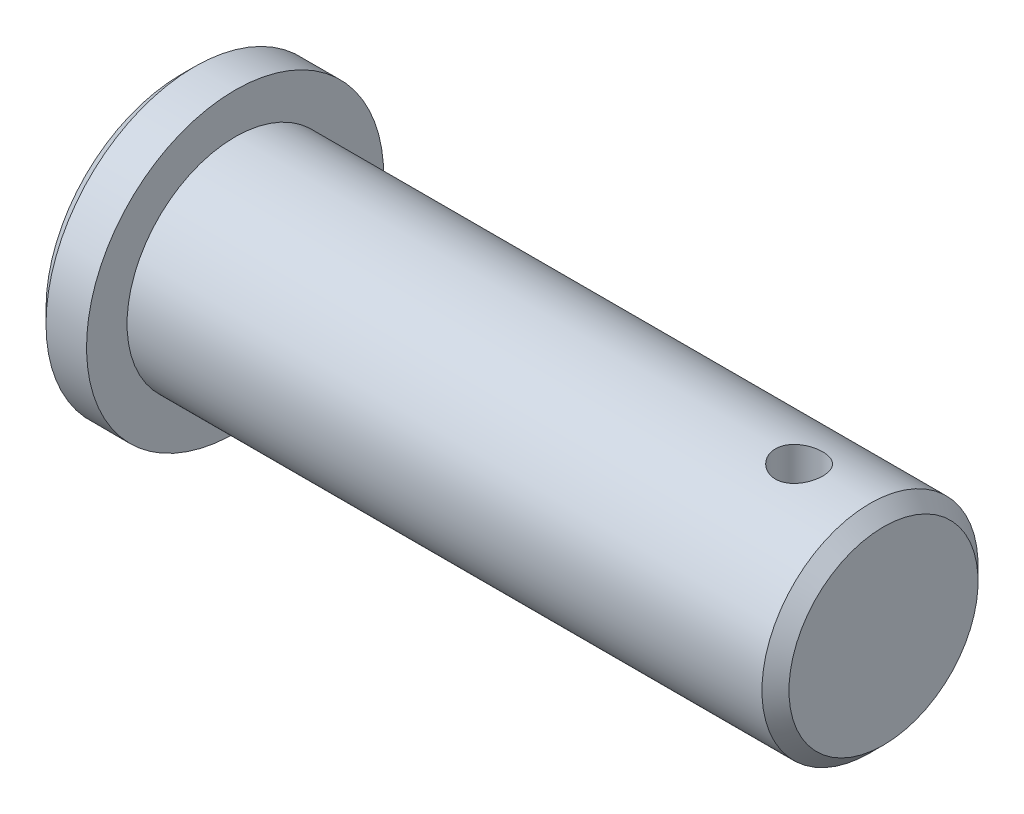
ISO-10303-21;
HEADER;
FILE_DESCRIPTION(('STEP AP214'),'2;1');
FILE_NAME('part.step','',(''),(''),'','','');
FILE_SCHEMA(('AUTOMOTIVE_DESIGN { 1 0 10303 214 1 1 1 1 }'));
ENDSEC;
DATA;
#1=APPLICATION_CONTEXT('core data for automotive mechanical design processes');
#2=APPLICATION_PROTOCOL_DEFINITION('international standard','automotive_design',2000,#1);
#3=PRODUCT_CONTEXT('',#1,'mechanical');
#4=PRODUCT('Part','Part','',(#3));
#5=PRODUCT_RELATED_PRODUCT_CATEGORY('part','',(#4));
#6=PRODUCT_DEFINITION_FORMATION('','',#4);
#7=PRODUCT_DEFINITION_CONTEXT('part definition',#1,'design');
#8=PRODUCT_DEFINITION('design','',#6,#7);
#9=PRODUCT_DEFINITION_SHAPE('','',#8);
#10=(LENGTH_UNIT() NAMED_UNIT(*) SI_UNIT(.MILLI.,.METRE.));
#11=(NAMED_UNIT(*) PLANE_ANGLE_UNIT() SI_UNIT($,.RADIAN.));
#12=(NAMED_UNIT(*) SI_UNIT($,.STERADIAN.) SOLID_ANGLE_UNIT());
#13=UNCERTAINTY_MEASURE_WITH_UNIT(LENGTH_MEASURE(1.E-05),#10,'distance_accuracy_value','');
#14=(GEOMETRIC_REPRESENTATION_CONTEXT(3) GLOBAL_UNCERTAINTY_ASSIGNED_CONTEXT((#13)) GLOBAL_UNIT_ASSIGNED_CONTEXT((#10,
#11,#12)) REPRESENTATION_CONTEXT('',''));
#15=CARTESIAN_POINT('',(0.,0.,0.));
#16=DIRECTION('',(0.,0.,1.));
#17=DIRECTION('',(1.,0.,0.));
#18=AXIS2_PLACEMENT_3D('',#15,#16,#17);
#19=CARTESIAN_POINT('',(0.,0.,0.));
#20=DIRECTION('',(-1.,0.,0.));
#21=DIRECTION('',(0.,-1.,0.));
#22=AXIS2_PLACEMENT_3D('',#19,#20,#21);
#23=PLANE('',#22);
#24=CARTESIAN_POINT('',(0.,0.,0.));
#25=DIRECTION('',(-1.,0.,0.));
#26=DIRECTION('',(0.,-1.,0.));
#27=AXIS2_PLACEMENT_3D('',#24,#25,#26);
#28=CIRCLE('',#27,9.99999999999997);
#29=CARTESIAN_POINT('',(0.,-9.99999999999997,0.));
#30=VERTEX_POINT('',#29);
#31=EDGE_CURVE('E12',#30,#30,#28,.T.);
#32=ORIENTED_EDGE('',*,*,#31,.T.);
#33=EDGE_LOOP('',(#32));
#34=FACE_BOUND('',#33,.T.);
#35=ADVANCED_FACE('F48',(#34),#23,.T.);
#36=CARTESIAN_POINT('',(52.,-1.66533453693773E-13,0.));
#37=DIRECTION('',(1.,0.,0.));
#38=DIRECTION('',(0.,1.,0.));
#39=AXIS2_PLACEMENT_3D('',#36,#37,#38);
#40=CYLINDRICAL_SURFACE('',#39,11.);
#41=CARTESIAN_POINT('',(1.00000000000003,0.,0.));
#42=DIRECTION('',(-1.,0.,0.));
#43=DIRECTION('',(0.,-1.,0.));
#44=AXIS2_PLACEMENT_3D('',#41,#42,#43);
#45=CIRCLE('',#44,11.);
#46=CARTESIAN_POINT('',(1.00000000000003,-11.,0.));
#47=VERTEX_POINT('',#46);
#48=EDGE_CURVE('E56',#47,#47,#45,.F.);
#49=ORIENTED_EDGE('',*,*,#48,.T.);
#50=EDGE_LOOP('',(#49));
#51=FACE_BOUND('',#50,.T.);
#52=CARTESIAN_POINT('',(4.,0.,0.));
#53=DIRECTION('',(1.,0.,0.));
#54=DIRECTION('',(0.,1.,0.));
#55=AXIS2_PLACEMENT_3D('',#52,#53,#54);
#56=CIRCLE('',#55,11.);
#57=CARTESIAN_POINT('',(4.,11.,0.));
#58=VERTEX_POINT('',#57);
#59=EDGE_CURVE('E69',#58,#58,#56,.T.);
#60=ORIENTED_EDGE('',*,*,#59,.F.);
#61=EDGE_LOOP('',(#60));
#62=FACE_BOUND('',#61,.T.);
#63=ADVANCED_FACE('F103',(#51,#62),#40,.T.);
#64=CARTESIAN_POINT('',(4.00000000000009,11.,0.));
#65=DIRECTION('',(1.,0.,0.));
#66=DIRECTION('',(0.,1.,0.));
#67=AXIS2_PLACEMENT_3D('',#64,#65,#66);
#68=PLANE('',#67);
#69=ORIENTED_EDGE('',*,*,#59,.T.);
#70=EDGE_LOOP('',(#69));
#71=FACE_BOUND('',#70,.T.);
#72=CARTESIAN_POINT('',(4.,0.,0.));
#73=DIRECTION('',(1.,0.,0.));
#74=DIRECTION('',(0.,1.,0.));
#75=AXIS2_PLACEMENT_3D('',#72,#73,#74);
#76=CIRCLE('',#75,8.);
#77=CARTESIAN_POINT('',(4.,8.,0.));
#78=VERTEX_POINT('',#77);
#79=EDGE_CURVE('E78',#78,#78,#76,.T.);
#80=ORIENTED_EDGE('',*,*,#79,.F.);
#81=EDGE_LOOP('',(#80));
#82=FACE_BOUND('',#81,.T.);
#83=ADVANCED_FACE('F100',(#71,#82),#68,.T.);
#84=CARTESIAN_POINT('',(52.,-1.66533453693773E-13,0.));
#85=DIRECTION('',(1.,0.,0.));
#86=DIRECTION('',(0.,1.,0.));
#87=AXIS2_PLACEMENT_3D('',#84,#85,#86);
#88=CYLINDRICAL_SURFACE('',#87,8.);
#89=CARTESIAN_POINT('',(51.,-1.66533453693773E-13,0.));
#90=DIRECTION('',(1.,0.,0.));
#91=DIRECTION('',(0.,1.,0.));
#92=AXIS2_PLACEMENT_3D('',#89,#90,#91);
#93=CIRCLE('',#92,8.);
#94=CARTESIAN_POINT('',(51.,7.99999999999983,0.));
#95=VERTEX_POINT('',#94);
#96=EDGE_CURVE('E60',#95,#95,#93,.F.);
#97=ORIENTED_EDGE('',*,*,#96,.T.);
#98=EDGE_LOOP('',(#97));
#99=FACE_BOUND('',#98,.T.);
#100=CARTESIAN_POINT('',(44.,7.99999999999984,0.));
#101=CARTESIAN_POINT('',(44.0000033142635,7.99999820976183,0.0970593350151634));
#102=CARTESIAN_POINT('',(44.0081019866613,7.9982157049818,0.194158718935764));
#103=CARTESIAN_POINT('',(44.0402490527665,7.99127711250693,0.38559939342519));
#104=CARTESIAN_POINT('',(44.0643088421448,7.9861186145083,0.479938663088241));
#105=CARTESIAN_POINT('',(44.127588488285,7.97300239075887,0.663064722809449));
#106=CARTESIAN_POINT('',(44.16679250776,7.96504759005967,0.751857201182264));
#107=CARTESIAN_POINT('',(44.2591974966815,7.94719730036176,0.921601058551578));
#108=CARTESIAN_POINT('',(44.3123981043793,7.93730186152146,1.00255264012588));
#109=CARTESIAN_POINT('',(44.4321897106249,7.91647673705155,1.15561917902204));
#110=CARTESIAN_POINT('',(44.498962313401,7.90553422192277,1.22759027771493));
#111=CARTESIAN_POINT('',(44.6436126129037,7.88393863133668,1.3594054745263));
#112=CARTESIAN_POINT('',(44.7214912989117,7.87328558176445,1.41924849117725));
#113=CARTESIAN_POINT('',(44.8872067655839,7.85334859305521,1.52574354875191));
#114=CARTESIAN_POINT('',(44.9751441231795,7.84408109293118,1.57224243577139));
#115=CARTESIAN_POINT('',(45.1578208420114,7.82814863989322,1.64974688983709));
#116=CARTESIAN_POINT('',(45.2525593882079,7.82148337574729,1.68075430981411));
#117=CARTESIAN_POINT('',(45.4445886950388,7.81164071268246,1.72592019766615));
#118=CARTESIAN_POINT('',(45.5418167912855,7.80841064771994,1.74033336961636));
#119=CARTESIAN_POINT('',(45.7373605607896,7.80564592573952,1.75269359259674));
#120=CARTESIAN_POINT('',(45.8356760988531,7.80611081439794,1.75064266801701));
#121=CARTESIAN_POINT('',(46.0287103351035,7.8106357936338,1.73033788658276));
#122=CARTESIAN_POINT('',(46.1234619300579,7.81463022611741,1.71237992433051));
#123=CARTESIAN_POINT('',(46.3085741129167,7.82566041064124,1.66123961776058));
#124=CARTESIAN_POINT('',(46.398934454106,7.8326963333431,1.62805641913033));
#125=CARTESIAN_POINT('',(46.5735309342898,7.84908142575229,1.5471359025917));
#126=CARTESIAN_POINT('',(46.6577125864212,7.858448566835,1.49928481262594));
#127=CARTESIAN_POINT('',(46.8169609182198,7.87842963219266,1.39046682908872));
#128=CARTESIAN_POINT('',(46.8920263529621,7.88904372636496,1.32949814730234));
#129=CARTESIAN_POINT('',(47.0326149603923,7.91060446260807,1.19460937489082));
#130=CARTESIAN_POINT('',(47.0978966247337,7.92155333191829,1.12043767851035));
#131=CARTESIAN_POINT('',(47.2151337625978,7.94234089245343,0.962075236204365));
#132=CARTESIAN_POINT('',(47.267088994629,7.95217956355836,0.877884308758433));
#133=CARTESIAN_POINT('',(47.3562581576324,7.96967012140703,0.701578448800833));
#134=CARTESIAN_POINT('',(47.3934404360735,7.97731730300512,0.6094470111021));
#135=CARTESIAN_POINT('',(47.4517288669676,7.98952827368563,0.420039431240132));
#136=CARTESIAN_POINT('',(47.4728373576619,7.99409251123058,0.322764039566416));
#137=CARTESIAN_POINT('',(47.4980277338165,7.99955949359521,0.127901429629168));
#138=CARTESIAN_POINT('',(47.5024395226814,8.0005331727692,0.0303587923624011));
#139=CARTESIAN_POINT('',(47.4950054564991,7.99890811067594,-0.164069740933717));
#140=CARTESIAN_POINT('',(47.4831607043853,7.99630961176494,-0.260955681068868));
#141=CARTESIAN_POINT('',(47.4438233351162,7.98787693126438,-0.450227474165155));
#142=CARTESIAN_POINT('',(47.4165037581911,7.98207854907278,-0.542651027433261));
#143=CARTESIAN_POINT('',(47.3471843139132,7.96789511342695,-0.721603760326955));
#144=CARTESIAN_POINT('',(47.3051831956978,7.95950983957756,-0.808132436960159));
#145=CARTESIAN_POINT('',(47.2070055863417,7.94090779663341,-0.974203283713581));
#146=CARTESIAN_POINT('',(47.1506352964623,7.93066659115609,-1.05362808603427));
#147=CARTESIAN_POINT('',(47.0255746886628,7.90953858077042,-1.20200932191071));
#148=CARTESIAN_POINT('',(46.9568827703147,7.89865169211886,-1.2709643934262));
#149=CARTESIAN_POINT('',(46.8076149766915,7.87721432670236,-1.39775310506235));
#150=CARTESIAN_POINT('',(46.7268433768909,7.8666737506977,-1.45535830381535));
#151=CARTESIAN_POINT('',(46.556578421308,7.84735161891479,-1.55618726114744));
#152=CARTESIAN_POINT('',(46.46708544312,7.83856998703283,-1.59941164199059));
#153=CARTESIAN_POINT('',(46.2823979646719,7.8238438879188,-1.66996009440667));
#154=CARTESIAN_POINT('',(46.1872389451376,7.81788350386428,-1.69737356394448));
#155=CARTESIAN_POINT('',(45.9935179953597,7.80944608384981,-1.73578387332272));
#156=CARTESIAN_POINT('',(45.8949566119869,7.80696849073831,-1.74678333897331));
#157=CARTESIAN_POINT('',(45.6995320753198,7.80581228747115,-1.75194163710046));
#158=CARTESIAN_POINT('',(45.6026787903827,7.80705196674931,-1.74646267912393));
#159=CARTESIAN_POINT('',(45.4113113769032,7.81300583032503,-1.71962942041961));
#160=CARTESIAN_POINT('',(45.3167972207982,7.81771997366199,-1.69827530684468));
#161=CARTESIAN_POINT('',(45.1330787683617,7.83005176572564,-1.64047291068329));
#162=CARTESIAN_POINT('',(45.0438571574274,7.83765926522119,-1.60407735181833));
#163=CARTESIAN_POINT('',(44.872732708445,7.85492457749738,-1.51727048968564));
#164=CARTESIAN_POINT('',(44.7908306342505,7.86458260391305,-1.46685772585982));
#165=CARTESIAN_POINT('',(44.6348846515863,7.8851048314272,-1.35224615086081));
#166=CARTESIAN_POINT('',(44.5610331054936,7.89598947159443,-1.28778921304301));
#167=CARTESIAN_POINT('',(44.4250757530738,7.91760116007119,-1.14744205512987));
#168=CARTESIAN_POINT('',(44.3629726659186,7.92832817136905,-1.07154919548322));
#169=CARTESIAN_POINT('',(44.2515036651478,7.94858104101283,-0.909297791240168));
#170=CARTESIAN_POINT('',(44.2023134872506,7.95808950687116,-0.822816221637437));
#171=CARTESIAN_POINT('',(44.1192452996235,7.97465942662421,-0.64262278337423));
#172=CARTESIAN_POINT('',(44.0853544503659,7.98172293121773,-0.548917055005231));
#173=CARTESIAN_POINT('',(44.039885963761,7.99134698819844,-0.379265181966476));
#174=CARTESIAN_POINT('',(44.0249572710945,7.99457176616451,-0.30423670792359));
#175=CARTESIAN_POINT('',(44.0050132041954,7.99889892979319,-0.152813724405269));
#176=CARTESIAN_POINT('',(43.9999973905281,8.00000140953651,-0.0764192756345294));
#177=CARTESIAN_POINT('',(44.,7.99999999999984,0.));
#178=B_SPLINE_CURVE_WITH_KNOTS('',3,(#100,#101,#102,#103,#104,#105,#106,#107,#108,#109,#110,
#111,#112,#113,#114,#115,#116,#117,#118,#119,#120,#121,#122,#123,#124,#125,#126,#127,#128,#129,
#130,#131,#132,#133,#134,#135,#136,#137,#138,#139,#140,#141,#142,#143,#144,#145,#146,#147,#148,
#149,#150,#151,#152,#153,#154,#155,#156,#157,#158,#159,#160,#161,#162,#163,#164,#165,#166,#167,
#168,#169,#170,#171,#172,#173,#174,#175,#176,#177),.UNSPECIFIED.,.T.,.F.,(4,2,2,2,2,2,2,2,2,2,2,
2,2,2,2,2,2,2,2,2,2,2,2,2,2,2,2,2,2,2,2,2,2,2,2,2,2,2,4),(0.,0.290898279236839,
0.582004473362001,0.872807059744413,1.16360213093151,1.45858009706577,1.7535843549802,
2.05185017097239,2.3500803029129,2.64366919108495,2.93722198074803,3.22542630469489,
3.51364680222945,3.80416202417277,4.09471687482171,4.39155618463579,4.68840087316609,
4.9858781948911,5.2833122345532,5.57483775277441,5.86634349327399,6.15465219015977,
6.44298545684156,6.73543477188155,7.02792210003658,7.3258010778639,7.62366716466541,
7.91983211728112,8.21594968619038,8.50560626091061,8.79525942091186,9.08390577736448,
9.37258222133173,9.66709530846839,9.96167647726523,10.2600801610668,10.5582329503546,
10.7872806901089,11.0163182760262),.UNSPECIFIED.);
#179=CARTESIAN_POINT('',(44.,7.99999999999984,0.));
#180=VERTEX_POINT('',#179);
#181=EDGE_CURVE('E70',#180,#180,#178,.T.);
#182=ORIENTED_EDGE('',*,*,#181,.F.);
#183=EDGE_LOOP('',(#182));
#184=FACE_BOUND('',#183,.T.);
#185=CARTESIAN_POINT('',(45.75,-7.80624749799813,1.75000000000001));
#186=CARTESIAN_POINT('',(45.6529719865672,-7.80624945905149,1.74999666332348));
#187=CARTESIAN_POINT('',(45.5559038686893,-7.8080762204647,1.74190303951004));
#188=CARTESIAN_POINT('',(45.3645280954781,-7.81517245186522,1.70977784205174));
#189=CARTESIAN_POINT('',(45.2702224871333,-7.82044441049029,1.68573474711855));
#190=CARTESIAN_POINT('',(45.0871677516,-7.83380603690756,1.62250390010282));
#191=CARTESIAN_POINT('',(44.9984126505749,-7.84189261163083,1.58333276753286));
#192=CARTESIAN_POINT('',(44.8287319161546,-7.85996859341382,1.49100532370988));
#193=CARTESIAN_POINT('',(44.7478061218132,-7.86995796134551,1.43784930002629));
#194=CARTESIAN_POINT('',(44.5947125378059,-7.89090255292077,1.31810359988614));
#195=CARTESIAN_POINT('',(44.522696298075,-7.90187013375066,1.25132229635414));
#196=CARTESIAN_POINT('',(44.3907933874916,-7.9234271970586,1.1066353778789));
#197=CARTESIAN_POINT('',(44.3309076596115,-7.93401665008999,1.02872889891569));
#198=CARTESIAN_POINT('',(44.2243662323318,-7.95375888221767,0.862987032725204));
#199=CARTESIAN_POINT('',(44.1778562952411,-7.96289538073803,0.775055841166024));
#200=CARTESIAN_POINT('',(44.100329736974,-7.97856268454458,0.592392423905279));
#201=CARTESIAN_POINT('',(44.0693113768744,-7.98509378226938,0.497660962897169));
#202=CARTESIAN_POINT('',(44.0241251174166,-7.99472708358202,0.305661830671541));
#203=CARTESIAN_POINT('',(44.0097007306068,-7.99788142586336,0.208457182926367));
#204=CARTESIAN_POINT('',(43.9973099404886,-8.00058645242078,0.0129599543265554));
#205=CARTESIAN_POINT('',(43.9993416539787,-8.00013754904477,-0.0853325007561016));
#206=CARTESIAN_POINT('',(44.0196143704453,-7.99572650969396,-0.278447020872945));
#207=CARTESIAN_POINT('',(44.0375789110752,-7.99182429717563,-0.373299678484476));
#208=CARTESIAN_POINT('',(44.0887667801185,-7.98101337797772,-0.55861051290044));
#209=CARTESIAN_POINT('',(44.1219907985543,-7.97410453534128,-0.649068490776125));
#210=CARTESIAN_POINT('',(44.2029990480669,-7.95796028660642,-0.823789626976177));
#211=CARTESIAN_POINT('',(44.2508880699226,-7.94870822179836,-0.908002597477628));
#212=CARTESIAN_POINT('',(44.3597887869978,-7.92889198192032,-1.06729782919219));
#213=CARTESIAN_POINT('',(44.4208022702585,-7.9183276281506,-1.14237884410838));
#214=CARTESIAN_POINT('',(44.5557250508591,-7.89678896628604,-1.28292311899119));
#215=CARTESIAN_POINT('',(44.6298763056075,-7.88581070205063,-1.34815369731024));
#216=CARTESIAN_POINT('',(44.7881789203944,-7.8648875061853,-1.46529720114584));
#217=CARTESIAN_POINT('',(44.8723305515244,-7.85494260258158,-1.51720976551524));
#218=CARTESIAN_POINT('',(45.0486214460871,-7.83720169317017,-1.60634709802241));
#219=CARTESIAN_POINT('',(45.1407836437077,-7.82941214351695,-1.64352787918374));
#220=CARTESIAN_POINT('',(45.3302586827383,-7.8169533742391,-1.70180410840341));
#221=CARTESIAN_POINT('',(45.4275707042846,-7.8122836595329,-1.72290210868729));
#222=CARTESIAN_POINT('',(45.6224569275024,-7.80669425421991,-1.74805293703088));
#223=CARTESIAN_POINT('',(45.7199853182606,-7.80570003585347,-1.75244457285898));
#224=CARTESIAN_POINT('',(45.9143807036213,-7.80737314858999,-1.74497530075208));
#225=CARTESIAN_POINT('',(46.0112477432107,-7.81004022809705,-1.73311550957759));
#226=CARTESIAN_POINT('',(46.200390915205,-7.81866504603992,-1.69377399635069));
#227=CARTESIAN_POINT('',(46.2927078240168,-7.82458345002025,-1.66647889658489));
#228=CARTESIAN_POINT('',(46.4714579700726,-7.83900857622719,-1.59724364761113));
#229=CARTESIAN_POINT('',(46.5578906431034,-7.84751554623339,-1.55530209637648));
#230=CARTESIAN_POINT('',(46.7238849784344,-7.86632301994191,-1.45721807999333));
#231=CARTESIAN_POINT('',(46.8033203592183,-7.87664912166262,-1.40086690882525));
#232=CARTESIAN_POINT('',(46.951731683694,-7.89786385707854,-1.27583634037905));
#233=CARTESIAN_POINT('',(47.0207063262301,-7.90875256052733,-1.20715541178422));
#234=CARTESIAN_POINT('',(47.147553370123,-7.93011129182098,-1.0578817609042));
#235=CARTESIAN_POINT('',(47.205194780229,-7.94056972743629,-0.977090811057807));
#236=CARTESIAN_POINT('',(47.3060872427295,-7.95967616453596,-0.806775937992829));
#237=CARTESIAN_POINT('',(47.349338967241,-7.96832425057156,-0.717252422909702));
#238=CARTESIAN_POINT('',(47.4199026469348,-7.98278670652048,-0.532571442115352));
#239=CARTESIAN_POINT('',(47.447315583873,-7.98861898874501,-0.437454026381437));
#240=CARTESIAN_POINT('',(47.4857388611449,-7.99687014437112,-0.243822113274706));
#241=CARTESIAN_POINT('',(47.4967515864831,-7.99928951409355,-0.145308111983488));
#242=CARTESIAN_POINT('',(47.5019545782729,-8.00042750683764,0.050127677576098));
#243=CARTESIAN_POINT('',(47.4964897231804,-7.99922200056385,0.147040003201601));
#244=CARTESIAN_POINT('',(47.4696641174079,-7.99340825361631,0.338529305331102));
#245=CARTESIAN_POINT('',(47.4483036525809,-7.98880007413333,0.433106323799668));
#246=CARTESIAN_POINT('',(47.3904584560635,-7.97670437671953,0.616973514243805));
#247=CARTESIAN_POINT('',(47.3540226473478,-7.96922617829746,0.706279729670005));
#248=CARTESIAN_POINT('',(47.2671087400606,-7.95218899565145,0.877557024231185));
#249=CARTESIAN_POINT('',(47.2166292781166,-7.94262980942264,0.95952739017258));
#250=CARTESIAN_POINT('',(47.1019365078449,-7.92224687676367,1.11548832576447));
#251=CARTESIAN_POINT('',(47.0374806844928,-7.91140257019308,1.18929788040885));
#252=CARTESIAN_POINT('',(46.897153999639,-7.88978238696421,1.32517104073326));
#253=CARTESIAN_POINT('',(46.8212803902359,-7.87900652743139,1.38723181070999));
#254=CARTESIAN_POINT('',(46.6590516072625,-7.85858267483539,1.49864533674961));
#255=CARTESIAN_POINT('',(46.5725698222905,-7.84895169360725,1.54781703198667));
#256=CARTESIAN_POINT('',(46.3923779767005,-7.83212199429241,1.63085060859479));
#257=CARTESIAN_POINT('',(46.2986741118073,-7.82492121927583,1.66472544549927));
#258=CARTESIAN_POINT('',(46.1290626393006,-7.81509833526512,1.71015691938045));
#259=CARTESIAN_POINT('',(46.0540749485233,-7.81180130346375,1.72506941603847));
#260=CARTESIAN_POINT('',(45.9027330776672,-7.80737516581769,1.7449920282687));
#261=CARTESIAN_POINT('',(45.8263789643878,-7.806245954287,1.75000262658061));
#262=CARTESIAN_POINT('',(45.75,-7.80624749799813,1.75000000000001));
#263=B_SPLINE_CURVE_WITH_KNOTS('',3,(#185,#186,#187,#188,#189,#190,#191,#192,#193,#194,#195,
#196,#197,#198,#199,#200,#201,#202,#203,#204,#205,#206,#207,#208,#209,#210,#211,#212,#213,#214,
#215,#216,#217,#218,#219,#220,#221,#222,#223,#224,#225,#226,#227,#228,#229,#230,#231,#232,#233,
#234,#235,#236,#237,#238,#239,#240,#241,#242,#243,#244,#245,#246,#247,#248,#249,#250,#251,#252,
#253,#254,#255,#256,#257,#258,#259,#260,#261,#262),.UNSPECIFIED.,.T.,.F.,(4,2,2,2,2,2,2,2,2,2,2,
2,2,2,2,2,2,2,2,2,2,2,2,2,2,2,2,2,2,2,2,2,2,2,2,2,2,2,4),(0.,0.290804115870682,
0.581818526599528,0.87251413705268,1.16320377043854,1.45830491896335,1.75342899855109,
2.05165686348639,2.34985124493558,2.64337184515388,2.93685885596571,3.22535086764111,
3.51385592599758,3.80447264140711,4.09512897475708,4.39183436537595,4.68854780096225,
4.98614062158783,5.28368620646373,5.57516431760518,5.86662240004894,6.15462969113394,
6.44266455918168,6.73513424501122,7.02764027980832,7.32560034403601,7.62354648911716,
7.91957146995092,8.21555339708045,8.50538367763983,8.79520874626518,9.0841005523157,
9.37302041407618,9.66742474155353,9.96190003653337,10.2603137141584,10.5584741768494,
10.7874018788085,11.0163184197546),.UNSPECIFIED.);
#264=CARTESIAN_POINT('',(45.75,-7.80624749799813,1.75000000000001));
#265=VERTEX_POINT('',#264);
#266=EDGE_CURVE('E79',#265,#265,#263,.T.);
#267=ORIENTED_EDGE('',*,*,#266,.F.);
#268=EDGE_LOOP('',(#267));
#269=FACE_BOUND('',#268,.T.);
#270=ORIENTED_EDGE('',*,*,#79,.T.);
#271=EDGE_LOOP('',(#270));
#272=FACE_BOUND('',#271,.T.);
#273=ADVANCED_FACE('F84',(#99,#184,#269,#272),#88,.T.);
#274=CARTESIAN_POINT('',(52.,7.99999999999984,0.));
#275=DIRECTION('',(1.,0.,0.));
#276=DIRECTION('',(0.,1.,0.));
#277=AXIS2_PLACEMENT_3D('',#274,#275,#276);
#278=PLANE('',#277);
#279=CARTESIAN_POINT('',(52.,-1.66533453693773E-13,0.));
#280=DIRECTION('',(1.,0.,0.));
#281=DIRECTION('',(0.,1.,0.));
#282=AXIS2_PLACEMENT_3D('',#279,#280,#281);
#283=CIRCLE('',#282,6.99999999999999);
#284=CARTESIAN_POINT('',(52.,6.99999999999983,0.));
#285=VERTEX_POINT('',#284);
#286=EDGE_CURVE('E64',#285,#285,#283,.T.);
#287=ORIENTED_EDGE('',*,*,#286,.T.);
#288=EDGE_LOOP('',(#287));
#289=FACE_BOUND('',#288,.T.);
#290=ADVANCED_FACE('F92',(#289),#278,.T.);
#291=CARTESIAN_POINT('',(45.75,-11.0000000000002,0.));
#292=DIRECTION('',(0.,1.,0.));
#293=DIRECTION('',(0.,0.,1.));
#294=AXIS2_PLACEMENT_3D('',#291,#292,#293);
#295=CYLINDRICAL_SURFACE('',#294,1.75);
#296=ORIENTED_EDGE('',*,*,#181,.T.);
#297=EDGE_LOOP('',(#296));
#298=FACE_BOUND('',#297,.T.);
#299=ORIENTED_EDGE('',*,*,#266,.T.);
#300=EDGE_LOOP('',(#299));
#301=FACE_BOUND('',#300,.T.);
#302=ADVANCED_FACE('F88',(#298,#301),#295,.F.);
#303=CARTESIAN_POINT('',(52.,-1.66533453693773E-13,0.));
#304=DIRECTION('',(-1.,0.,0.));
#305=DIRECTION('',(0.,-1.,0.));
#306=AXIS2_PLACEMENT_3D('',#303,#304,#305);
#307=CONICAL_SURFACE('',#306,6.99999999999999,0.785398163397448);
#308=ORIENTED_EDGE('',*,*,#96,.F.);
#309=EDGE_LOOP('',(#308));
#310=FACE_BOUND('',#309,.T.);
#311=ORIENTED_EDGE('',*,*,#286,.F.);
#312=EDGE_LOOP('',(#311));
#313=FACE_BOUND('',#312,.T.);
#314=ADVANCED_FACE('F91',(#310,#313),#307,.T.);
#315=CARTESIAN_POINT('',(1.00000000000003,0.,0.));
#316=DIRECTION('',(1.,0.,0.));
#317=DIRECTION('',(0.,1.,0.));
#318=AXIS2_PLACEMENT_3D('',#315,#316,#317);
#319=CONICAL_SURFACE('',#318,11.,0.785398163397453);
#320=ORIENTED_EDGE('',*,*,#31,.F.);
#321=EDGE_LOOP('',(#320));
#322=FACE_BOUND('',#321,.T.);
#323=ORIENTED_EDGE('',*,*,#48,.F.);
#324=EDGE_LOOP('',(#323));
#325=FACE_BOUND('',#324,.T.);
#326=ADVANCED_FACE('F51',(#322,#325),#319,.T.);
#327=CLOSED_SHELL('',(#35,#63,#83,#273,#290,#302,#314,#326));
#328=MANIFOLD_SOLID_BREP('B2',#327);
#329=ADVANCED_BREP_SHAPE_REPRESENTATION('',(#18,#328),#14);
#330=SHAPE_DEFINITION_REPRESENTATION(#9,#329);
ENDSEC;
END-ISO-10303-21;
